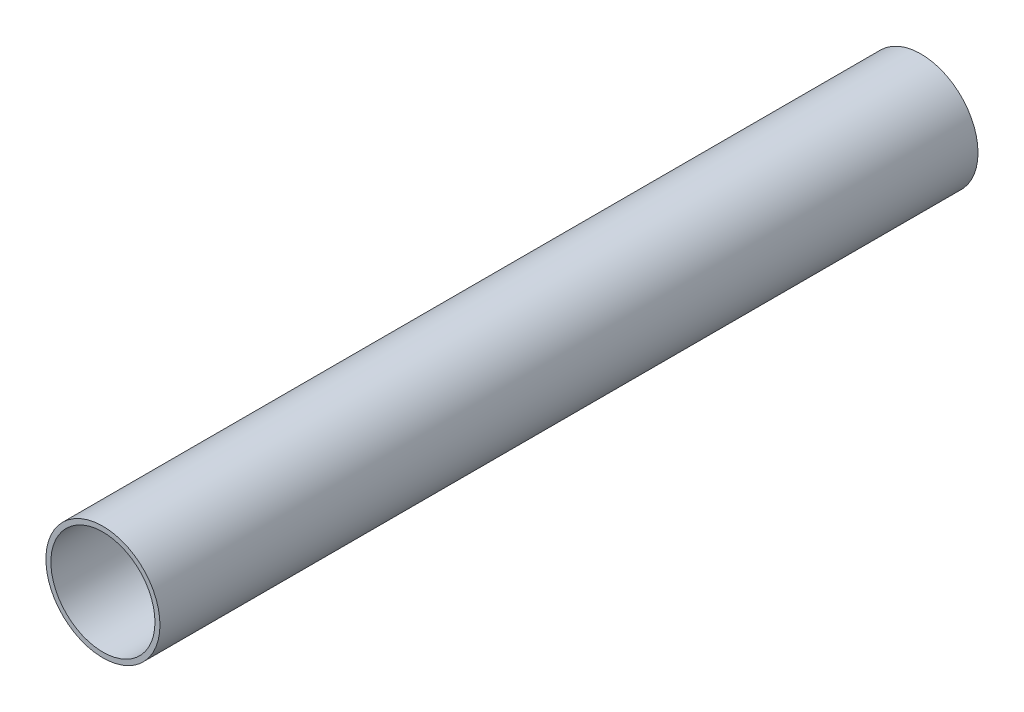
ISO-10303-21;
HEADER;
FILE_DESCRIPTION(('STEP AP214'),'2;1');
FILE_NAME('part.step','',(''),(''),'','','');
FILE_SCHEMA(('AUTOMOTIVE_DESIGN { 1 0 10303 214 1 1 1 1 }'));
ENDSEC;
DATA;
#1=APPLICATION_CONTEXT('core data for automotive mechanical design processes');
#2=APPLICATION_PROTOCOL_DEFINITION('international standard','automotive_design',2000,#1);
#3=PRODUCT_CONTEXT('',#1,'mechanical');
#4=PRODUCT('Part','Part','',(#3));
#5=PRODUCT_RELATED_PRODUCT_CATEGORY('part','',(#4));
#6=PRODUCT_DEFINITION_FORMATION('','',#4);
#7=PRODUCT_DEFINITION_CONTEXT('part definition',#1,'design');
#8=PRODUCT_DEFINITION('design','',#6,#7);
#9=PRODUCT_DEFINITION_SHAPE('','',#8);
#10=(LENGTH_UNIT() NAMED_UNIT(*) SI_UNIT(.MILLI.,.METRE.));
#11=(NAMED_UNIT(*) PLANE_ANGLE_UNIT() SI_UNIT($,.RADIAN.));
#12=(NAMED_UNIT(*) SI_UNIT($,.STERADIAN.) SOLID_ANGLE_UNIT());
#13=UNCERTAINTY_MEASURE_WITH_UNIT(LENGTH_MEASURE(1.E-05),#10,'distance_accuracy_value','');
#14=(GEOMETRIC_REPRESENTATION_CONTEXT(3) GLOBAL_UNCERTAINTY_ASSIGNED_CONTEXT((#13)) GLOBAL_UNIT_ASSIGNED_CONTEXT((#10,
#11,#12)) REPRESENTATION_CONTEXT('',''));
#15=CARTESIAN_POINT('',(0.,0.,0.));
#16=DIRECTION('',(0.,0.,1.));
#17=DIRECTION('',(1.,0.,0.));
#18=AXIS2_PLACEMENT_3D('',#15,#16,#17);
#19=CARTESIAN_POINT('',(0.,0.,228.6));
#20=DIRECTION('',(0.,0.,1.));
#21=DIRECTION('',(1.,0.,0.));
#22=AXIS2_PLACEMENT_3D('',#19,#20,#21);
#23=PLANE('',#22);
#24=CARTESIAN_POINT('',(0.,0.,228.6));
#25=DIRECTION('',(0.,0.,1.));
#26=DIRECTION('',(1.,0.,0.));
#27=AXIS2_PLACEMENT_3D('',#24,#25,#26);
#28=CIRCLE('',#27,15.9385);
#29=CARTESIAN_POINT('',(15.9385,0.,228.6));
#30=VERTEX_POINT('',#29);
#31=EDGE_CURVE('E10',#30,#30,#28,.T.);
#32=ORIENTED_EDGE('',*,*,#31,.T.);
#33=EDGE_LOOP('',(#32));
#34=FACE_BOUND('',#33,.T.);
#35=CARTESIAN_POINT('',(0.,0.,228.6));
#36=DIRECTION('',(0.,0.,1.));
#37=DIRECTION('',(1.,0.,0.));
#38=AXIS2_PLACEMENT_3D('',#35,#36,#37);
#39=CIRCLE('',#38,14.5415);
#40=CARTESIAN_POINT('',(14.5415,0.,228.6));
#41=VERTEX_POINT('',#40);
#42=EDGE_CURVE('E42',#41,#41,#39,.T.);
#43=ORIENTED_EDGE('',*,*,#42,.F.);
#44=EDGE_LOOP('',(#43));
#45=FACE_BOUND('',#44,.T.);
#46=ADVANCED_FACE('F31',(#34,#45),#23,.T.);
#47=CARTESIAN_POINT('',(0.,0.,0.));
#48=DIRECTION('',(0.,0.,1.));
#49=DIRECTION('',(1.,0.,0.));
#50=AXIS2_PLACEMENT_3D('',#47,#48,#49);
#51=PLANE('',#50);
#52=CARTESIAN_POINT('',(0.,0.,0.));
#53=DIRECTION('',(0.,0.,1.));
#54=DIRECTION('',(1.,0.,0.));
#55=AXIS2_PLACEMENT_3D('',#52,#53,#54);
#56=CIRCLE('',#55,15.9385);
#57=CARTESIAN_POINT('',(15.9385,0.,0.));
#58=VERTEX_POINT('',#57);
#59=EDGE_CURVE('E35',#58,#58,#56,.T.);
#60=ORIENTED_EDGE('',*,*,#59,.F.);
#61=EDGE_LOOP('',(#60));
#62=FACE_BOUND('',#61,.T.);
#63=CARTESIAN_POINT('',(0.,0.,0.));
#64=DIRECTION('',(0.,0.,1.));
#65=DIRECTION('',(1.,0.,0.));
#66=AXIS2_PLACEMENT_3D('',#63,#64,#65);
#67=CIRCLE('',#66,14.5415);
#68=CARTESIAN_POINT('',(14.5415,0.,0.));
#69=VERTEX_POINT('',#68);
#70=EDGE_CURVE('E44',#69,#69,#67,.T.);
#71=ORIENTED_EDGE('',*,*,#70,.T.);
#72=EDGE_LOOP('',(#71));
#73=FACE_BOUND('',#72,.T.);
#74=ADVANCED_FACE('F54',(#62,#73),#51,.F.);
#75=CARTESIAN_POINT('',(0.,0.,228.6));
#76=DIRECTION('',(0.,0.,-1.));
#77=DIRECTION('',(-1.,0.,0.));
#78=AXIS2_PLACEMENT_3D('',#75,#76,#77);
#79=CYLINDRICAL_SURFACE('',#78,15.9385);
#80=ORIENTED_EDGE('',*,*,#31,.F.);
#81=EDGE_LOOP('',(#80));
#82=FACE_BOUND('',#81,.T.);
#83=ORIENTED_EDGE('',*,*,#59,.T.);
#84=EDGE_LOOP('',(#83));
#85=FACE_BOUND('',#84,.T.);
#86=ADVANCED_FACE('F33',(#82,#85),#79,.T.);
#87=CARTESIAN_POINT('',(0.,0.,228.6));
#88=DIRECTION('',(0.,0.,-1.));
#89=DIRECTION('',(-1.,0.,0.));
#90=AXIS2_PLACEMENT_3D('',#87,#88,#89);
#91=CYLINDRICAL_SURFACE('',#90,14.5415);
#92=ORIENTED_EDGE('',*,*,#42,.T.);
#93=EDGE_LOOP('',(#92));
#94=FACE_BOUND('',#93,.T.);
#95=ORIENTED_EDGE('',*,*,#70,.F.);
#96=EDGE_LOOP('',(#95));
#97=FACE_BOUND('',#96,.T.);
#98=ADVANCED_FACE('F50',(#94,#97),#91,.F.);
#99=CLOSED_SHELL('',(#46,#74,#86,#98));
#100=MANIFOLD_SOLID_BREP('B2',#99);
#101=ADVANCED_BREP_SHAPE_REPRESENTATION('',(#18,#100),#14);
#102=SHAPE_DEFINITION_REPRESENTATION(#9,#101);
ENDSEC;
END-ISO-10303-21;
